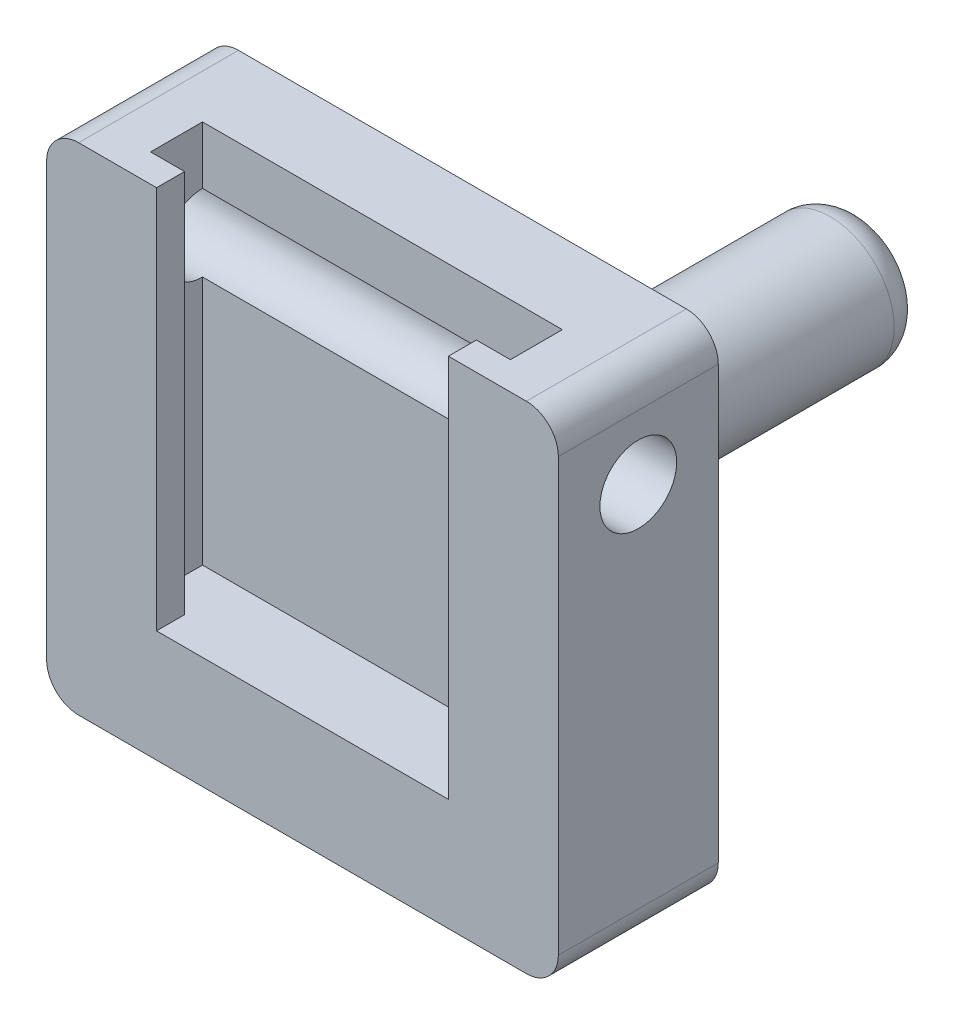
ISO-10303-21;
HEADER;
FILE_DESCRIPTION(('STEP AP214'),'2;1');
FILE_NAME('part.step','',(''),(''),'','','');
FILE_SCHEMA(('AUTOMOTIVE_DESIGN { 1 0 10303 214 1 1 1 1 }'));
ENDSEC;
DATA;
#1=APPLICATION_CONTEXT('core data for automotive mechanical design processes');
#2=APPLICATION_PROTOCOL_DEFINITION('international standard','automotive_design',2000,#1);
#3=PRODUCT_CONTEXT('',#1,'mechanical');
#4=PRODUCT('Part','Part','',(#3));
#5=PRODUCT_RELATED_PRODUCT_CATEGORY('part','',(#4));
#6=PRODUCT_DEFINITION_FORMATION('','',#4);
#7=PRODUCT_DEFINITION_CONTEXT('part definition',#1,'design');
#8=PRODUCT_DEFINITION('design','',#6,#7);
#9=PRODUCT_DEFINITION_SHAPE('','',#8);
#10=(LENGTH_UNIT() NAMED_UNIT(*) SI_UNIT(.MILLI.,.METRE.));
#11=(NAMED_UNIT(*) PLANE_ANGLE_UNIT() SI_UNIT($,.RADIAN.));
#12=(NAMED_UNIT(*) SI_UNIT($,.STERADIAN.) SOLID_ANGLE_UNIT());
#13=UNCERTAINTY_MEASURE_WITH_UNIT(LENGTH_MEASURE(1.E-05),#10,'distance_accuracy_value','');
#14=(GEOMETRIC_REPRESENTATION_CONTEXT(3) GLOBAL_UNCERTAINTY_ASSIGNED_CONTEXT((#13)) GLOBAL_UNIT_ASSIGNED_CONTEXT((#10,
#11,#12)) REPRESENTATION_CONTEXT('',''));
#15=CARTESIAN_POINT('',(0.,0.,0.));
#16=DIRECTION('',(0.,0.,1.));
#17=DIRECTION('',(1.,0.,0.));
#18=AXIS2_PLACEMENT_3D('',#15,#16,#17);
#19=CARTESIAN_POINT('',(-15.9999999999999,17.5,0.));
#20=DIRECTION('',(1.,0.,0.));
#21=DIRECTION('',(0.,0.,-1.));
#22=AXIS2_PLACEMENT_3D('',#19,#20,#21);
#23=PLANE('',#22);
#24=DIRECTION('',(0.,-1.,0.));
#25=VECTOR('',#24,1.);
#26=CARTESIAN_POINT('',(-15.9999999999999,17.5,0.));
#27=LINE('',#26,#25);
#28=CARTESIAN_POINT('',(-15.9999999999999,15.5,0.));
#29=VERTEX_POINT('',#28);
#30=CARTESIAN_POINT('',(-15.9999999999999,-11.5000000000001,0.));
#31=VERTEX_POINT('',#30);
#32=EDGE_CURVE('E264',#29,#31,#27,.T.);
#33=ORIENTED_EDGE('',*,*,#32,.T.);
#34=DIRECTION('',(0.,0.,-1.));
#35=VECTOR('',#34,1.);
#36=CARTESIAN_POINT('',(-15.9999999999999,-11.5000000000001,0.));
#37=LINE('',#36,#35);
#38=CARTESIAN_POINT('',(-15.9999999999999,-11.5000000000001,10.));
#39=VERTEX_POINT('',#38);
#40=EDGE_CURVE('E301',#31,#39,#37,.F.);
#41=ORIENTED_EDGE('',*,*,#40,.T.);
#42=DIRECTION('',(0.,-1.,0.));
#43=VECTOR('',#42,1.);
#44=CARTESIAN_POINT('',(-15.9999999999999,17.5,10.));
#45=LINE('',#44,#43);
#46=CARTESIAN_POINT('',(-15.9999999999999,15.5,10.));
#47=VERTEX_POINT('',#46);
#48=EDGE_CURVE('E181',#47,#39,#45,.T.);
#49=ORIENTED_EDGE('',*,*,#48,.F.);
#50=DIRECTION('',(0.,0.,1.));
#51=VECTOR('',#50,1.);
#52=CARTESIAN_POINT('',(-15.9999999999999,15.5,0.));
#53=LINE('',#52,#51);
#54=EDGE_CURVE('E299',#47,#29,#53,.F.);
#55=ORIENTED_EDGE('',*,*,#54,.T.);
#56=EDGE_LOOP('',(#33,#41,#49,#55));
#57=FACE_BOUND('',#56,.T.);
#58=CARTESIAN_POINT('',(-15.9999999999999,11.5,5.));
#59=DIRECTION('',(-1.,0.,0.));
#60=DIRECTION('',(0.,0.,1.));
#61=AXIS2_PLACEMENT_3D('',#58,#59,#60);
#62=CIRCLE('',#61,2.4);
#63=CARTESIAN_POINT('',(-15.9999999999999,11.5,7.4));
#64=VERTEX_POINT('',#63);
#65=EDGE_CURVE('E192',#64,#64,#62,.T.);
#66=ORIENTED_EDGE('',*,*,#65,.F.);
#67=EDGE_LOOP('',(#66));
#68=FACE_BOUND('',#67,.T.);
#69=ADVANCED_FACE('F43',(#57,#68),#23,.F.);
#70=CARTESIAN_POINT('',(-15.9999999999999,17.5,10.));
#71=DIRECTION('',(0.,0.,-1.));
#72=DIRECTION('',(-1.,0.,0.));
#73=AXIS2_PLACEMENT_3D('',#70,#71,#72);
#74=PLANE('',#73);
#75=ORIENTED_EDGE('',*,*,#48,.T.);
#76=CARTESIAN_POINT('',(-13.9999999999999,-11.5000000000001,10.));
#77=DIRECTION('',(0.,0.,-1.));
#78=DIRECTION('',(-1.,0.,0.));
#79=AXIS2_PLACEMENT_3D('',#76,#77,#78);
#80=CIRCLE('',#79,2.);
#81=CARTESIAN_POINT('',(-13.9999999999999,-13.5000000000001,10.));
#82=VERTEX_POINT('',#81);
#83=EDGE_CURVE('E310',#39,#82,#80,.F.);
#84=ORIENTED_EDGE('',*,*,#83,.T.);
#85=DIRECTION('',(1.,0.,0.));
#86=VECTOR('',#85,1.);
#87=CARTESIAN_POINT('',(-15.9999999999999,-13.5000000000001,10.));
#88=LINE('',#87,#86);
#89=CARTESIAN_POINT('',(14.0000000000001,-13.5000000000001,10.));
#90=VERTEX_POINT('',#89);
#91=EDGE_CURVE('E194',#82,#90,#88,.T.);
#92=ORIENTED_EDGE('',*,*,#91,.T.);
#93=CARTESIAN_POINT('',(14.0000000000001,-11.5000000000001,10.));
#94=DIRECTION('',(0.,0.,-1.));
#95=DIRECTION('',(-1.,0.,0.));
#96=AXIS2_PLACEMENT_3D('',#93,#94,#95);
#97=CIRCLE('',#96,2.);
#98=CARTESIAN_POINT('',(16.0000000000001,-11.5000000000001,10.));
#99=VERTEX_POINT('',#98);
#100=EDGE_CURVE('E304',#90,#99,#97,.F.);
#101=ORIENTED_EDGE('',*,*,#100,.T.);
#102=DIRECTION('',(0.,-1.,0.));
#103=VECTOR('',#102,1.);
#104=CARTESIAN_POINT('',(16.0000000000001,17.5,10.));
#105=LINE('',#104,#103);
#106=CARTESIAN_POINT('',(16.0000000000001,15.5,10.));
#107=VERTEX_POINT('',#106);
#108=EDGE_CURVE('E268',#107,#99,#105,.T.);
#109=ORIENTED_EDGE('',*,*,#108,.F.);
#110=CARTESIAN_POINT('',(14.0000000000001,15.5,10.));
#111=DIRECTION('',(0.,0.,-1.));
#112=DIRECTION('',(-1.,0.,0.));
#113=AXIS2_PLACEMENT_3D('',#110,#111,#112);
#114=CIRCLE('',#113,2.);
#115=CARTESIAN_POINT('',(14.0000000000001,17.5,10.));
#116=VERTEX_POINT('',#115);
#117=EDGE_CURVE('E65',#107,#116,#114,.F.);
#118=ORIENTED_EDGE('',*,*,#117,.T.);
#119=DIRECTION('',(1.,0.,0.));
#120=VECTOR('',#119,1.);
#121=CARTESIAN_POINT('',(-15.9999999999999,17.5,10.));
#122=LINE('',#121,#120);
#123=CARTESIAN_POINT('',(9.125,17.5,10.));
#124=VERTEX_POINT('',#123);
#125=EDGE_CURVE('E246',#124,#116,#122,.T.);
#126=ORIENTED_EDGE('',*,*,#125,.F.);
#127=DIRECTION('',(0.,1.,0.));
#128=VECTOR('',#127,1.);
#129=CARTESIAN_POINT('',(9.125,-36.5488611432323,10.));
#130=LINE('',#129,#128);
#131=CARTESIAN_POINT('',(9.125,-6.50000000000007,10.));
#132=VERTEX_POINT('',#131);
#133=EDGE_CURVE('E245',#132,#124,#130,.T.);
#134=ORIENTED_EDGE('',*,*,#133,.F.);
#135=DIRECTION('',(-1.,0.,0.));
#136=VECTOR('',#135,1.);
#137=CARTESIAN_POINT('',(-9.125,-6.50000000000007,10.));
#138=LINE('',#137,#136);
#139=CARTESIAN_POINT('',(-9.125,-6.50000000000007,10.));
#140=VERTEX_POINT('',#139);
#141=EDGE_CURVE('E209',#132,#140,#138,.T.);
#142=ORIENTED_EDGE('',*,*,#141,.T.);
#143=DIRECTION('',(0.,1.,0.));
#144=VECTOR('',#143,1.);
#145=CARTESIAN_POINT('',(-9.125,-36.5488611432323,10.));
#146=LINE('',#145,#144);
#147=CARTESIAN_POINT('',(-9.125,17.5,10.));
#148=VERTEX_POINT('',#147);
#149=EDGE_CURVE('E243',#140,#148,#146,.T.);
#150=ORIENTED_EDGE('',*,*,#149,.T.);
#151=CARTESIAN_POINT('',(-13.9999999999999,17.5,10.));
#152=VERTEX_POINT('',#151);
#153=EDGE_CURVE('E258',#152,#148,#122,.T.);
#154=ORIENTED_EDGE('',*,*,#153,.F.);
#155=CARTESIAN_POINT('',(-13.9999999999999,15.5,10.));
#156=DIRECTION('',(0.,0.,-1.));
#157=DIRECTION('',(-1.,0.,0.));
#158=AXIS2_PLACEMENT_3D('',#155,#156,#157);
#159=CIRCLE('',#158,2.);
#160=EDGE_CURVE('E59',#152,#47,#159,.F.);
#161=ORIENTED_EDGE('',*,*,#160,.T.);
#162=EDGE_LOOP('',(#75,#84,#92,#101,#109,#118,#126,#134,#142,#150,#154,#161));
#163=FACE_BOUND('',#162,.T.);
#164=ADVANCED_FACE('F329',(#163),#74,.F.);
#165=CARTESIAN_POINT('',(16.0000000000001,17.5,0.));
#166=DIRECTION('',(-1.,0.,0.));
#167=DIRECTION('',(0.,0.,1.));
#168=AXIS2_PLACEMENT_3D('',#165,#166,#167);
#169=PLANE('',#168);
#170=ORIENTED_EDGE('',*,*,#108,.T.);
#171=DIRECTION('',(0.,0.,-1.));
#172=VECTOR('',#171,1.);
#173=CARTESIAN_POINT('',(16.0000000000001,-11.5000000000001,0.));
#174=LINE('',#173,#172);
#175=CARTESIAN_POINT('',(16.0000000000001,-11.5000000000001,0.));
#176=VERTEX_POINT('',#175);
#177=EDGE_CURVE('E311',#99,#176,#174,.T.);
#178=ORIENTED_EDGE('',*,*,#177,.T.);
#179=DIRECTION('',(0.,-1.,0.));
#180=VECTOR('',#179,1.);
#181=CARTESIAN_POINT('',(16.0000000000001,17.5,0.));
#182=LINE('',#181,#180);
#183=CARTESIAN_POINT('',(16.0000000000001,15.5,0.));
#184=VERTEX_POINT('',#183);
#185=EDGE_CURVE('E269',#184,#176,#182,.T.);
#186=ORIENTED_EDGE('',*,*,#185,.F.);
#187=DIRECTION('',(0.,0.,-1.));
#188=VECTOR('',#187,1.);
#189=CARTESIAN_POINT('',(16.0000000000001,15.5,10.));
#190=LINE('',#189,#188);
#191=EDGE_CURVE('E307',#184,#107,#190,.F.);
#192=ORIENTED_EDGE('',*,*,#191,.T.);
#193=EDGE_LOOP('',(#170,#178,#186,#192));
#194=FACE_BOUND('',#193,.T.);
#195=CARTESIAN_POINT('',(16.0000000000001,11.5,5.));
#196=DIRECTION('',(-1.,0.,0.));
#197=DIRECTION('',(0.,0.,1.));
#198=AXIS2_PLACEMENT_3D('',#195,#196,#197);
#199=CIRCLE('',#198,2.39999999999999);
#200=CARTESIAN_POINT('',(16.0000000000001,11.5,7.39999999999999));
#201=VERTEX_POINT('',#200);
#202=EDGE_CURVE('E218',#201,#201,#199,.T.);
#203=ORIENTED_EDGE('',*,*,#202,.T.);
#204=EDGE_LOOP('',(#203));
#205=FACE_BOUND('',#204,.T.);
#206=ADVANCED_FACE('F381',(#194,#205),#169,.F.);
#207=CARTESIAN_POINT('',(-15.9999999999999,17.5,0.));
#208=DIRECTION('',(0.,0.,1.));
#209=DIRECTION('',(1.,0.,0.));
#210=AXIS2_PLACEMENT_3D('',#207,#208,#209);
#211=PLANE('',#210);
#212=CARTESIAN_POINT('',(0.,0.,0.));
#213=DIRECTION('',(0.,0.,1.));
#214=DIRECTION('',(1.,0.,0.));
#215=AXIS2_PLACEMENT_3D('',#212,#213,#214);
#216=CIRCLE('',#215,6.);
#217=CARTESIAN_POINT('',(6.,0.,0.));
#218=VERTEX_POINT('',#217);
#219=EDGE_CURVE('E290',#218,#218,#216,.T.);
#220=ORIENTED_EDGE('',*,*,#219,.T.);
#221=EDGE_LOOP('',(#220));
#222=FACE_BOUND('',#221,.T.);
#223=DIRECTION('',(1.,0.,0.));
#224=VECTOR('',#223,1.);
#225=CARTESIAN_POINT('',(-15.9999999999999,-13.5000000000001,0.));
#226=LINE('',#225,#224);
#227=CARTESIAN_POINT('',(-13.9999999999999,-13.5000000000001,0.));
#228=VERTEX_POINT('',#227);
#229=CARTESIAN_POINT('',(14.0000000000001,-13.5000000000001,0.));
#230=VERTEX_POINT('',#229);
#231=EDGE_CURVE('E206',#228,#230,#226,.T.);
#232=ORIENTED_EDGE('',*,*,#231,.F.);
#233=CARTESIAN_POINT('',(-13.9999999999999,-11.5000000000001,0.));
#234=DIRECTION('',(0.,0.,1.));
#235=DIRECTION('',(1.,0.,0.));
#236=AXIS2_PLACEMENT_3D('',#233,#234,#235);
#237=CIRCLE('',#236,2.);
#238=EDGE_CURVE('E287',#228,#31,#237,.F.);
#239=ORIENTED_EDGE('',*,*,#238,.T.);
#240=ORIENTED_EDGE('',*,*,#32,.F.);
#241=CARTESIAN_POINT('',(-13.9999999999999,15.5,0.));
#242=DIRECTION('',(0.,0.,1.));
#243=DIRECTION('',(1.,0.,0.));
#244=AXIS2_PLACEMENT_3D('',#241,#242,#243);
#245=CIRCLE('',#244,2.);
#246=CARTESIAN_POINT('',(-13.9999999999999,17.5,0.));
#247=VERTEX_POINT('',#246);
#248=EDGE_CURVE('E285',#29,#247,#245,.F.);
#249=ORIENTED_EDGE('',*,*,#248,.T.);
#250=DIRECTION('',(-1.,0.,0.));
#251=VECTOR('',#250,1.);
#252=CARTESIAN_POINT('',(-15.9999999999999,17.5,0.));
#253=LINE('',#252,#251);
#254=CARTESIAN_POINT('',(14.0000000000001,17.5,0.));
#255=VERTEX_POINT('',#254);
#256=EDGE_CURVE('E263',#255,#247,#253,.T.);
#257=ORIENTED_EDGE('',*,*,#256,.F.);
#258=CARTESIAN_POINT('',(14.0000000000001,15.5,0.));
#259=DIRECTION('',(0.,0.,1.));
#260=DIRECTION('',(1.,0.,0.));
#261=AXIS2_PLACEMENT_3D('',#258,#259,#260);
#262=CIRCLE('',#261,2.);
#263=EDGE_CURVE('E280',#255,#184,#262,.F.);
#264=ORIENTED_EDGE('',*,*,#263,.T.);
#265=ORIENTED_EDGE('',*,*,#185,.T.);
#266=CARTESIAN_POINT('',(14.0000000000001,-11.5000000000001,0.));
#267=DIRECTION('',(0.,0.,1.));
#268=DIRECTION('',(1.,0.,0.));
#269=AXIS2_PLACEMENT_3D('',#266,#267,#268);
#270=CIRCLE('',#269,2.);
#271=EDGE_CURVE('E284',#176,#230,#270,.F.);
#272=ORIENTED_EDGE('',*,*,#271,.T.);
#273=EDGE_LOOP('',(#232,#239,#240,#249,#257,#264,#265,#272));
#274=FACE_BOUND('',#273,.T.);
#275=ADVANCED_FACE('F322',(#222,#274),#211,.F.);
#276=CARTESIAN_POINT('',(0.,17.5,0.));
#277=DIRECTION('',(0.,1.,0.));
#278=DIRECTION('',(0.,0.,1.));
#279=AXIS2_PLACEMENT_3D('',#276,#277,#278);
#280=PLANE('',#279);
#281=ORIENTED_EDGE('',*,*,#256,.T.);
#282=DIRECTION('',(0.,0.,1.));
#283=VECTOR('',#282,1.);
#284=CARTESIAN_POINT('',(-13.9999999999999,17.5,10.));
#285=LINE('',#284,#283);
#286=EDGE_CURVE('E11',#247,#152,#285,.T.);
#287=ORIENTED_EDGE('',*,*,#286,.T.);
#288=ORIENTED_EDGE('',*,*,#153,.T.);
#289=DIRECTION('',(0.,0.,1.));
#290=VECTOR('',#289,1.);
#291=CARTESIAN_POINT('',(-9.125,17.5,10.));
#292=LINE('',#291,#290);
#293=CARTESIAN_POINT('',(-9.125,17.5,8.25));
#294=VERTEX_POINT('',#293);
#295=EDGE_CURVE('E237',#294,#148,#292,.T.);
#296=ORIENTED_EDGE('',*,*,#295,.F.);
#297=DIRECTION('',(1.,0.,0.));
#298=VECTOR('',#297,1.);
#299=CARTESIAN_POINT('',(-9.125,17.5,8.25));
#300=LINE('',#299,#298);
#301=CARTESIAN_POINT('',(-11.25,17.5,8.25));
#302=VERTEX_POINT('',#301);
#303=EDGE_CURVE('E236',#302,#294,#300,.T.);
#304=ORIENTED_EDGE('',*,*,#303,.F.);
#305=DIRECTION('',(0.,0.,1.));
#306=VECTOR('',#305,1.);
#307=CARTESIAN_POINT('',(-11.25,17.5,8.25));
#308=LINE('',#307,#306);
#309=CARTESIAN_POINT('',(-11.25,17.5,5.));
#310=VERTEX_POINT('',#309);
#311=EDGE_CURVE('E231',#310,#302,#308,.T.);
#312=ORIENTED_EDGE('',*,*,#311,.F.);
#313=DIRECTION('',(-1.,0.,0.));
#314=VECTOR('',#313,1.);
#315=CARTESIAN_POINT('',(-11.25,17.5,5.));
#316=LINE('',#315,#314);
#317=CARTESIAN_POINT('',(11.25,17.5,5.));
#318=VERTEX_POINT('',#317);
#319=EDGE_CURVE('E229',#318,#310,#316,.T.);
#320=ORIENTED_EDGE('',*,*,#319,.F.);
#321=DIRECTION('',(0.,0.,-1.));
#322=VECTOR('',#321,1.);
#323=CARTESIAN_POINT('',(11.25,17.5,5.));
#324=LINE('',#323,#322);
#325=CARTESIAN_POINT('',(11.25,17.5,8.25));
#326=VERTEX_POINT('',#325);
#327=EDGE_CURVE('E226',#326,#318,#324,.T.);
#328=ORIENTED_EDGE('',*,*,#327,.F.);
#329=DIRECTION('',(1.,0.,0.));
#330=VECTOR('',#329,1.);
#331=CARTESIAN_POINT('',(11.25,17.5,8.25));
#332=LINE('',#331,#330);
#333=CARTESIAN_POINT('',(9.125,17.5,8.25));
#334=VERTEX_POINT('',#333);
#335=EDGE_CURVE('E223',#334,#326,#332,.T.);
#336=ORIENTED_EDGE('',*,*,#335,.F.);
#337=DIRECTION('',(0.,0.,-1.));
#338=VECTOR('',#337,1.);
#339=CARTESIAN_POINT('',(9.125,17.5,8.25));
#340=LINE('',#339,#338);
#341=EDGE_CURVE('E224',#124,#334,#340,.T.);
#342=ORIENTED_EDGE('',*,*,#341,.F.);
#343=ORIENTED_EDGE('',*,*,#125,.T.);
#344=DIRECTION('',(0.,0.,-1.));
#345=VECTOR('',#344,1.);
#346=CARTESIAN_POINT('',(14.0000000000001,17.5,0.));
#347=LINE('',#346,#345);
#348=EDGE_CURVE('E51',#116,#255,#347,.T.);
#349=ORIENTED_EDGE('',*,*,#348,.T.);
#350=EDGE_LOOP('',(#281,#287,#288,#296,#304,#312,#320,#328,#336,#342,#343,#349));
#351=FACE_BOUND('',#350,.T.);
#352=ADVANCED_FACE('F320',(#351),#280,.T.);
#353=CARTESIAN_POINT('',(-9.125,-36.5488611432323,10.));
#354=DIRECTION('',(-1.,0.,0.));
#355=DIRECTION('',(0.,0.,1.));
#356=AXIS2_PLACEMENT_3D('',#353,#354,#355);
#357=PLANE('',#356);
#358=DIRECTION('',(0.,1.,0.));
#359=VECTOR('',#358,1.);
#360=CARTESIAN_POINT('',(-9.125,-36.5488611432323,8.25));
#361=LINE('',#360,#359);
#362=CARTESIAN_POINT('',(-9.125,-6.50000000000007,8.25));
#363=VERTEX_POINT('',#362);
#364=EDGE_CURVE('E250',#363,#294,#361,.T.);
#365=ORIENTED_EDGE('',*,*,#364,.T.);
#366=ORIENTED_EDGE('',*,*,#295,.T.);
#367=ORIENTED_EDGE('',*,*,#149,.F.);
#368=DIRECTION('',(0.,0.,-1.));
#369=VECTOR('',#368,1.);
#370=CARTESIAN_POINT('',(-9.125,-6.50000000000007,10.));
#371=LINE('',#370,#369);
#372=EDGE_CURVE('E340',#140,#363,#371,.T.);
#373=ORIENTED_EDGE('',*,*,#372,.T.);
#374=EDGE_LOOP('',(#365,#366,#367,#373));
#375=FACE_BOUND('',#374,.T.);
#376=ADVANCED_FACE('F337',(#375),#357,.F.);
#377=CARTESIAN_POINT('',(-9.125,-36.5488611432323,8.25));
#378=DIRECTION('',(0.,0.,1.));
#379=DIRECTION('',(1.,0.,0.));
#380=AXIS2_PLACEMENT_3D('',#377,#378,#379);
#381=PLANE('',#380);
#382=DIRECTION('',(0.,1.,0.));
#383=VECTOR('',#382,1.);
#384=CARTESIAN_POINT('',(-11.25,-36.5488611432323,8.25));
#385=LINE('',#384,#383);
#386=CARTESIAN_POINT('',(-11.25,-6.50000000000007,8.25));
#387=VERTEX_POINT('',#386);
#388=EDGE_CURVE('E248',#387,#302,#385,.T.);
#389=ORIENTED_EDGE('',*,*,#388,.T.);
#390=ORIENTED_EDGE('',*,*,#303,.T.);
#391=ORIENTED_EDGE('',*,*,#364,.F.);
#392=DIRECTION('',(-1.,0.,0.));
#393=VECTOR('',#392,1.);
#394=CARTESIAN_POINT('',(-9.125,-6.50000000000007,8.25));
#395=LINE('',#394,#393);
#396=EDGE_CURVE('E343',#363,#387,#395,.T.);
#397=ORIENTED_EDGE('',*,*,#396,.T.);
#398=EDGE_LOOP('',(#389,#390,#391,#397));
#399=FACE_BOUND('',#398,.T.);
#400=ADVANCED_FACE('F368',(#399),#381,.F.);
#401=CARTESIAN_POINT('',(-11.25,-36.5488611432323,8.25));
#402=DIRECTION('',(-1.,0.,0.));
#403=DIRECTION('',(0.,0.,1.));
#404=AXIS2_PLACEMENT_3D('',#401,#402,#403);
#405=PLANE('',#404);
#406=ORIENTED_EDGE('',*,*,#388,.F.);
#407=DIRECTION('',(0.,0.,-1.));
#408=VECTOR('',#407,1.);
#409=CARTESIAN_POINT('',(-11.25,-6.50000000000007,8.25));
#410=LINE('',#409,#408);
#411=CARTESIAN_POINT('',(-11.25,-6.50000000000007,5.));
#412=VERTEX_POINT('',#411);
#413=EDGE_CURVE('E348',#387,#412,#410,.T.);
#414=ORIENTED_EDGE('',*,*,#413,.T.);
#415=DIRECTION('',(0.,1.,0.));
#416=VECTOR('',#415,1.);
#417=CARTESIAN_POINT('',(-11.25,-36.5488611432323,5.));
#418=LINE('',#417,#416);
#419=CARTESIAN_POINT('',(-11.25,9.09999999999996,5.));
#420=VERTEX_POINT('',#419);
#421=EDGE_CURVE('E199',#412,#420,#418,.T.);
#422=ORIENTED_EDGE('',*,*,#421,.T.);
#423=CARTESIAN_POINT('',(-11.25,11.5,5.));
#424=DIRECTION('',(-1.,0.,0.));
#425=DIRECTION('',(0.,0.,1.));
#426=AXIS2_PLACEMENT_3D('',#423,#424,#425);
#427=CIRCLE('',#426,2.4);
#428=CARTESIAN_POINT('',(-11.25,13.9,5.));
#429=VERTEX_POINT('',#428);
#430=EDGE_CURVE('E189',#420,#429,#427,.T.);
#431=ORIENTED_EDGE('',*,*,#430,.T.);
#432=DIRECTION('',(0.,1.,0.));
#433=VECTOR('',#432,1.);
#434=CARTESIAN_POINT('',(-11.25,-36.5488611432323,5.));
#435=LINE('',#434,#433);
#436=EDGE_CURVE('E252',#429,#310,#435,.T.);
#437=ORIENTED_EDGE('',*,*,#436,.T.);
#438=ORIENTED_EDGE('',*,*,#311,.T.);
#439=EDGE_LOOP('',(#406,#414,#422,#431,#437,#438));
#440=FACE_BOUND('',#439,.T.);
#441=ADVANCED_FACE('F364',(#440),#405,.F.);
#442=CARTESIAN_POINT('',(-11.25,-36.5488611432323,5.));
#443=DIRECTION('',(0.,0.,-1.));
#444=DIRECTION('',(-1.,0.,0.));
#445=AXIS2_PLACEMENT_3D('',#442,#443,#444);
#446=PLANE('',#445);
#447=ORIENTED_EDGE('',*,*,#436,.F.);
#448=DIRECTION('',(-1.,0.,0.));
#449=VECTOR('',#448,1.);
#450=CARTESIAN_POINT('',(-15.9999999999999,13.9,5.));
#451=LINE('',#450,#449);
#452=CARTESIAN_POINT('',(11.25,13.9,5.));
#453=VERTEX_POINT('',#452);
#454=EDGE_CURVE('E219',#429,#453,#451,.F.);
#455=ORIENTED_EDGE('',*,*,#454,.T.);
#456=DIRECTION('',(0.,1.,0.));
#457=VECTOR('',#456,1.);
#458=CARTESIAN_POINT('',(11.25,-36.5488611432323,5.));
#459=LINE('',#458,#457);
#460=EDGE_CURVE('E180',#453,#318,#459,.T.);
#461=ORIENTED_EDGE('',*,*,#460,.T.);
#462=ORIENTED_EDGE('',*,*,#319,.T.);
#463=EDGE_LOOP('',(#447,#455,#461,#462));
#464=FACE_BOUND('',#463,.T.);
#465=ADVANCED_FACE('F372',(#464),#446,.F.);
#466=CARTESIAN_POINT('',(11.25,-36.5488611432323,5.));
#467=DIRECTION('',(1.,0.,0.));
#468=DIRECTION('',(0.,0.,-1.));
#469=AXIS2_PLACEMENT_3D('',#466,#467,#468);
#470=PLANE('',#469);
#471=ORIENTED_EDGE('',*,*,#460,.F.);
#472=CARTESIAN_POINT('',(11.25,11.5,5.));
#473=DIRECTION('',(1.,0.,0.));
#474=DIRECTION('',(0.,0.,-1.));
#475=AXIS2_PLACEMENT_3D('',#472,#473,#474);
#476=CIRCLE('',#475,2.4);
#477=CARTESIAN_POINT('',(11.25,9.09999999999996,5.));
#478=VERTEX_POINT('',#477);
#479=EDGE_CURVE('E167',#453,#478,#476,.T.);
#480=ORIENTED_EDGE('',*,*,#479,.T.);
#481=DIRECTION('',(0.,1.,0.));
#482=VECTOR('',#481,1.);
#483=CARTESIAN_POINT('',(11.25,-36.5488611432323,5.));
#484=LINE('',#483,#482);
#485=CARTESIAN_POINT('',(11.25,-6.50000000000007,5.));
#486=VERTEX_POINT('',#485);
#487=EDGE_CURVE('E174',#486,#478,#484,.T.);
#488=ORIENTED_EDGE('',*,*,#487,.F.);
#489=DIRECTION('',(0.,0.,1.));
#490=VECTOR('',#489,1.);
#491=CARTESIAN_POINT('',(11.25,-6.50000000000007,5.));
#492=LINE('',#491,#490);
#493=CARTESIAN_POINT('',(11.25,-6.50000000000007,8.25));
#494=VERTEX_POINT('',#493);
#495=EDGE_CURVE('E352',#486,#494,#492,.T.);
#496=ORIENTED_EDGE('',*,*,#495,.T.);
#497=DIRECTION('',(0.,1.,0.));
#498=VECTOR('',#497,1.);
#499=CARTESIAN_POINT('',(11.25,-36.5488611432323,8.25));
#500=LINE('',#499,#498);
#501=EDGE_CURVE('E251',#494,#326,#500,.T.);
#502=ORIENTED_EDGE('',*,*,#501,.T.);
#503=ORIENTED_EDGE('',*,*,#327,.T.);
#504=EDGE_LOOP('',(#471,#480,#488,#496,#502,#503));
#505=FACE_BOUND('',#504,.T.);
#506=ADVANCED_FACE('F175',(#505),#470,.F.);
#507=CARTESIAN_POINT('',(11.25,-36.5488611432323,8.25));
#508=DIRECTION('',(0.,0.,1.));
#509=DIRECTION('',(1.,0.,0.));
#510=AXIS2_PLACEMENT_3D('',#507,#508,#509);
#511=PLANE('',#510);
#512=DIRECTION('',(0.,1.,0.));
#513=VECTOR('',#512,1.);
#514=CARTESIAN_POINT('',(9.125,-36.5488611432323,8.25));
#515=LINE('',#514,#513);
#516=CARTESIAN_POINT('',(9.125,-6.50000000000007,8.25));
#517=VERTEX_POINT('',#516);
#518=EDGE_CURVE('E256',#517,#334,#515,.T.);
#519=ORIENTED_EDGE('',*,*,#518,.T.);
#520=ORIENTED_EDGE('',*,*,#335,.T.);
#521=ORIENTED_EDGE('',*,*,#501,.F.);
#522=DIRECTION('',(-1.,0.,0.));
#523=VECTOR('',#522,1.);
#524=CARTESIAN_POINT('',(11.25,-6.50000000000007,8.25));
#525=LINE('',#524,#523);
#526=EDGE_CURVE('E202',#494,#517,#525,.T.);
#527=ORIENTED_EDGE('',*,*,#526,.T.);
#528=EDGE_LOOP('',(#519,#520,#521,#527));
#529=FACE_BOUND('',#528,.T.);
#530=ADVANCED_FACE('F358',(#529),#511,.F.);
#531=CARTESIAN_POINT('',(9.125,-36.5488611432323,8.25));
#532=DIRECTION('',(1.,0.,0.));
#533=DIRECTION('',(0.,0.,-1.));
#534=AXIS2_PLACEMENT_3D('',#531,#532,#533);
#535=PLANE('',#534);
#536=ORIENTED_EDGE('',*,*,#133,.T.);
#537=ORIENTED_EDGE('',*,*,#341,.T.);
#538=ORIENTED_EDGE('',*,*,#518,.F.);
#539=DIRECTION('',(0.,0.,1.));
#540=VECTOR('',#539,1.);
#541=CARTESIAN_POINT('',(9.125,-6.50000000000007,8.25));
#542=LINE('',#541,#540);
#543=EDGE_CURVE('E203',#517,#132,#542,.T.);
#544=ORIENTED_EDGE('',*,*,#543,.T.);
#545=EDGE_LOOP('',(#536,#537,#538,#544));
#546=FACE_BOUND('',#545,.T.);
#547=ADVANCED_FACE('F356',(#546),#535,.F.);
#548=CARTESIAN_POINT('',(-15.9999999999999,11.5,5.));
#549=DIRECTION('',(-1.,0.,0.));
#550=DIRECTION('',(0.,0.,1.));
#551=AXIS2_PLACEMENT_3D('',#548,#549,#550);
#552=CYLINDRICAL_SURFACE('',#551,2.4);
#553=ORIENTED_EDGE('',*,*,#65,.T.);
#554=EDGE_LOOP('',(#553));
#555=FACE_BOUND('',#554,.T.);
#556=ORIENTED_EDGE('',*,*,#430,.F.);
#557=DIRECTION('',(-1.,0.,0.));
#558=VECTOR('',#557,1.);
#559=CARTESIAN_POINT('',(-15.9999999999999,9.09999999999996,5.));
#560=LINE('',#559,#558);
#561=EDGE_CURVE('E183',#478,#420,#560,.T.);
#562=ORIENTED_EDGE('',*,*,#561,.F.);
#563=ORIENTED_EDGE('',*,*,#479,.F.);
#564=ORIENTED_EDGE('',*,*,#454,.F.);
#565=EDGE_LOOP('',(#556,#562,#563,#564));
#566=FACE_BOUND('',#565,.T.);
#567=ORIENTED_EDGE('',*,*,#202,.F.);
#568=EDGE_LOOP('',(#567));
#569=FACE_BOUND('',#568,.T.);
#570=ADVANCED_FACE('F184',(#555,#566,#569),#552,.F.);
#571=CARTESIAN_POINT('',(-15.9999999999999,-13.5000000000001,10.));
#572=DIRECTION('',(0.,1.,0.));
#573=DIRECTION('',(0.,0.,1.));
#574=AXIS2_PLACEMENT_3D('',#571,#572,#573);
#575=PLANE('',#574);
#576=ORIENTED_EDGE('',*,*,#91,.F.);
#577=DIRECTION('',(0.,0.,-1.));
#578=VECTOR('',#577,1.);
#579=CARTESIAN_POINT('',(-13.9999999999999,-13.5000000000001,10.));
#580=LINE('',#579,#578);
#581=EDGE_CURVE('E298',#82,#228,#580,.T.);
#582=ORIENTED_EDGE('',*,*,#581,.T.);
#583=ORIENTED_EDGE('',*,*,#231,.T.);
#584=DIRECTION('',(0.,0.,-1.));
#585=VECTOR('',#584,1.);
#586=CARTESIAN_POINT('',(14.0000000000001,-13.5000000000001,10.));
#587=LINE('',#586,#585);
#588=EDGE_CURVE('E295',#230,#90,#587,.F.);
#589=ORIENTED_EDGE('',*,*,#588,.T.);
#590=EDGE_LOOP('',(#576,#582,#583,#589));
#591=FACE_BOUND('',#590,.T.);
#592=ADVANCED_FACE('F420',(#591),#575,.F.);
#593=CARTESIAN_POINT('',(0.,0.,-25.));
#594=DIRECTION('',(0.,0.,1.));
#595=DIRECTION('',(1.,0.,0.));
#596=AXIS2_PLACEMENT_3D('',#593,#594,#595);
#597=CYLINDRICAL_SURFACE('',#596,4.);
#598=CARTESIAN_POINT('',(0.,0.,-2.));
#599=DIRECTION('',(0.,0.,1.));
#600=DIRECTION('',(1.,0.,0.));
#601=AXIS2_PLACEMENT_3D('',#598,#599,#600);
#602=CIRCLE('',#601,4.);
#603=CARTESIAN_POINT('',(4.,0.,-2.));
#604=VERTEX_POINT('',#603);
#605=EDGE_CURVE('E277',#604,#604,#602,.F.);
#606=ORIENTED_EDGE('',*,*,#605,.T.);
#607=EDGE_LOOP('',(#606));
#608=FACE_BOUND('',#607,.T.);
#609=CARTESIAN_POINT('',(0.,0.,-23.));
#610=DIRECTION('',(0.,0.,-1.));
#611=DIRECTION('',(-1.,0.,0.));
#612=AXIS2_PLACEMENT_3D('',#609,#610,#611);
#613=CIRCLE('',#612,4.);
#614=CARTESIAN_POINT('',(-4.,0.,-23.));
#615=VERTEX_POINT('',#614);
#616=EDGE_CURVE('E179',#615,#615,#613,.F.);
#617=ORIENTED_EDGE('',*,*,#616,.T.);
#618=EDGE_LOOP('',(#617));
#619=FACE_BOUND('',#618,.T.);
#620=ADVANCED_FACE('F421',(#608,#619),#597,.T.);
#621=CARTESIAN_POINT('',(0.,0.,-25.));
#622=DIRECTION('',(0.,0.,-1.));
#623=DIRECTION('',(-1.,0.,0.));
#624=AXIS2_PLACEMENT_3D('',#621,#622,#623);
#625=PLANE('',#624);
#626=CARTESIAN_POINT('',(0.,0.,-25.));
#627=DIRECTION('',(0.,0.,-1.));
#628=DIRECTION('',(-1.,0.,0.));
#629=AXIS2_PLACEMENT_3D('',#626,#627,#628);
#630=CIRCLE('',#629,2.);
#631=CARTESIAN_POINT('',(-2.,0.,-25.));
#632=VERTEX_POINT('',#631);
#633=EDGE_CURVE('E293',#632,#632,#630,.T.);
#634=ORIENTED_EDGE('',*,*,#633,.T.);
#635=EDGE_LOOP('',(#634));
#636=FACE_BOUND('',#635,.T.);
#637=ADVANCED_FACE('F429',(#636),#625,.T.);
#638=CARTESIAN_POINT('',(-11.25,-36.5488611432323,5.));
#639=DIRECTION('',(0.,0.,-1.));
#640=DIRECTION('',(-1.,0.,0.));
#641=AXIS2_PLACEMENT_3D('',#638,#639,#640);
#642=PLANE('',#641);
#643=ORIENTED_EDGE('',*,*,#487,.T.);
#644=ORIENTED_EDGE('',*,*,#561,.T.);
#645=ORIENTED_EDGE('',*,*,#421,.F.);
#646=DIRECTION('',(1.,0.,0.));
#647=VECTOR('',#646,1.);
#648=CARTESIAN_POINT('',(-11.25,-6.50000000000007,5.));
#649=LINE('',#648,#647);
#650=EDGE_CURVE('E200',#412,#486,#649,.T.);
#651=ORIENTED_EDGE('',*,*,#650,.T.);
#652=EDGE_LOOP('',(#643,#644,#645,#651));
#653=FACE_BOUND('',#652,.T.);
#654=ADVANCED_FACE('F195',(#653),#642,.F.);
#655=CARTESIAN_POINT('',(-15.9999999999999,-6.50000000000007,10.));
#656=DIRECTION('',(0.,1.,0.));
#657=DIRECTION('',(0.,0.,1.));
#658=AXIS2_PLACEMENT_3D('',#655,#656,#657);
#659=PLANE('',#658);
#660=ORIENTED_EDGE('',*,*,#141,.F.);
#661=ORIENTED_EDGE('',*,*,#543,.F.);
#662=ORIENTED_EDGE('',*,*,#526,.F.);
#663=ORIENTED_EDGE('',*,*,#495,.F.);
#664=ORIENTED_EDGE('',*,*,#650,.F.);
#665=ORIENTED_EDGE('',*,*,#413,.F.);
#666=ORIENTED_EDGE('',*,*,#396,.F.);
#667=ORIENTED_EDGE('',*,*,#372,.F.);
#668=EDGE_LOOP('',(#660,#661,#662,#663,#664,#665,#666,#667));
#669=FACE_BOUND('',#668,.T.);
#670=ADVANCED_FACE('F338',(#669),#659,.T.);
#671=CARTESIAN_POINT('',(0.,0.,-2.));
#672=DIRECTION('',(0.,0.,1.));
#673=DIRECTION('',(1.,0.,0.));
#674=AXIS2_PLACEMENT_3D('',#671,#672,#673);
#675=TOROIDAL_SURFACE('',#674,6.,2.);
#676=ORIENTED_EDGE('',*,*,#219,.F.);
#677=EDGE_LOOP('',(#676));
#678=FACE_BOUND('',#677,.T.);
#679=ORIENTED_EDGE('',*,*,#605,.F.);
#680=EDGE_LOOP('',(#679));
#681=FACE_BOUND('',#680,.T.);
#682=ADVANCED_FACE('F388',(#678,#681),#675,.F.);
#683=CARTESIAN_POINT('',(0.,0.,-23.));
#684=DIRECTION('',(0.,0.,-1.));
#685=DIRECTION('',(-1.,0.,0.));
#686=AXIS2_PLACEMENT_3D('',#683,#684,#685);
#687=DEGENERATE_TOROIDAL_SURFACE('',#686,2.,2.,.T.);
#688=ORIENTED_EDGE('',*,*,#616,.F.);
#689=EDGE_LOOP('',(#688));
#690=FACE_BOUND('',#689,.T.);
#691=ORIENTED_EDGE('',*,*,#633,.F.);
#692=EDGE_LOOP('',(#691));
#693=FACE_BOUND('',#692,.T.);
#694=ADVANCED_FACE('F395',(#690,#693),#687,.T.);
#695=CARTESIAN_POINT('',(-13.9999999999999,-11.5000000000001,10.));
#696=DIRECTION('',(0.,0.,-1.));
#697=DIRECTION('',(-1.,0.,0.));
#698=AXIS2_PLACEMENT_3D('',#695,#696,#697);
#699=CYLINDRICAL_SURFACE('',#698,2.);
#700=ORIENTED_EDGE('',*,*,#83,.F.);
#701=ORIENTED_EDGE('',*,*,#40,.F.);
#702=ORIENTED_EDGE('',*,*,#238,.F.);
#703=ORIENTED_EDGE('',*,*,#581,.F.);
#704=EDGE_LOOP('',(#700,#701,#702,#703));
#705=FACE_BOUND('',#704,.T.);
#706=ADVANCED_FACE('F397',(#705),#699,.T.);
#707=CARTESIAN_POINT('',(14.0000000000001,-11.5000000000001,0.));
#708=DIRECTION('',(0.,0.,-1.));
#709=DIRECTION('',(-1.,0.,0.));
#710=AXIS2_PLACEMENT_3D('',#707,#708,#709);
#711=CYLINDRICAL_SURFACE('',#710,2.);
#712=ORIENTED_EDGE('',*,*,#100,.F.);
#713=ORIENTED_EDGE('',*,*,#588,.F.);
#714=ORIENTED_EDGE('',*,*,#271,.F.);
#715=ORIENTED_EDGE('',*,*,#177,.F.);
#716=EDGE_LOOP('',(#712,#713,#714,#715));
#717=FACE_BOUND('',#716,.T.);
#718=ADVANCED_FACE('F398',(#717),#711,.T.);
#719=CARTESIAN_POINT('',(-13.9999999999999,15.5,0.));
#720=DIRECTION('',(0.,0.,-1.));
#721=DIRECTION('',(-1.,0.,0.));
#722=AXIS2_PLACEMENT_3D('',#719,#720,#721);
#723=CYLINDRICAL_SURFACE('',#722,2.);
#724=ORIENTED_EDGE('',*,*,#248,.F.);
#725=ORIENTED_EDGE('',*,*,#54,.F.);
#726=ORIENTED_EDGE('',*,*,#160,.F.);
#727=ORIENTED_EDGE('',*,*,#286,.F.);
#728=EDGE_LOOP('',(#724,#725,#726,#727));
#729=FACE_BOUND('',#728,.T.);
#730=ADVANCED_FACE('F328',(#729),#723,.T.);
#731=CARTESIAN_POINT('',(14.0000000000001,15.5,0.));
#732=DIRECTION('',(0.,0.,1.));
#733=DIRECTION('',(1.,0.,0.));
#734=AXIS2_PLACEMENT_3D('',#731,#732,#733);
#735=CYLINDRICAL_SURFACE('',#734,2.);
#736=ORIENTED_EDGE('',*,*,#117,.F.);
#737=ORIENTED_EDGE('',*,*,#191,.F.);
#738=ORIENTED_EDGE('',*,*,#263,.F.);
#739=ORIENTED_EDGE('',*,*,#348,.F.);
#740=EDGE_LOOP('',(#736,#737,#738,#739));
#741=FACE_BOUND('',#740,.T.);
#742=ADVANCED_FACE('F44',(#741),#735,.T.);
#743=CLOSED_SHELL('',(#69,#164,#206,#275,#352,#376,#400,#441,#465,#506,#530,#547,#570,#592,#620,
#637,#654,#670,#682,#694,#706,#718,#730,#742));
#744=MANIFOLD_SOLID_BREP('B2',#743);
#745=ADVANCED_BREP_SHAPE_REPRESENTATION('',(#18,#744),#14);
#746=SHAPE_DEFINITION_REPRESENTATION(#9,#745);
ENDSEC;
END-ISO-10303-21;
